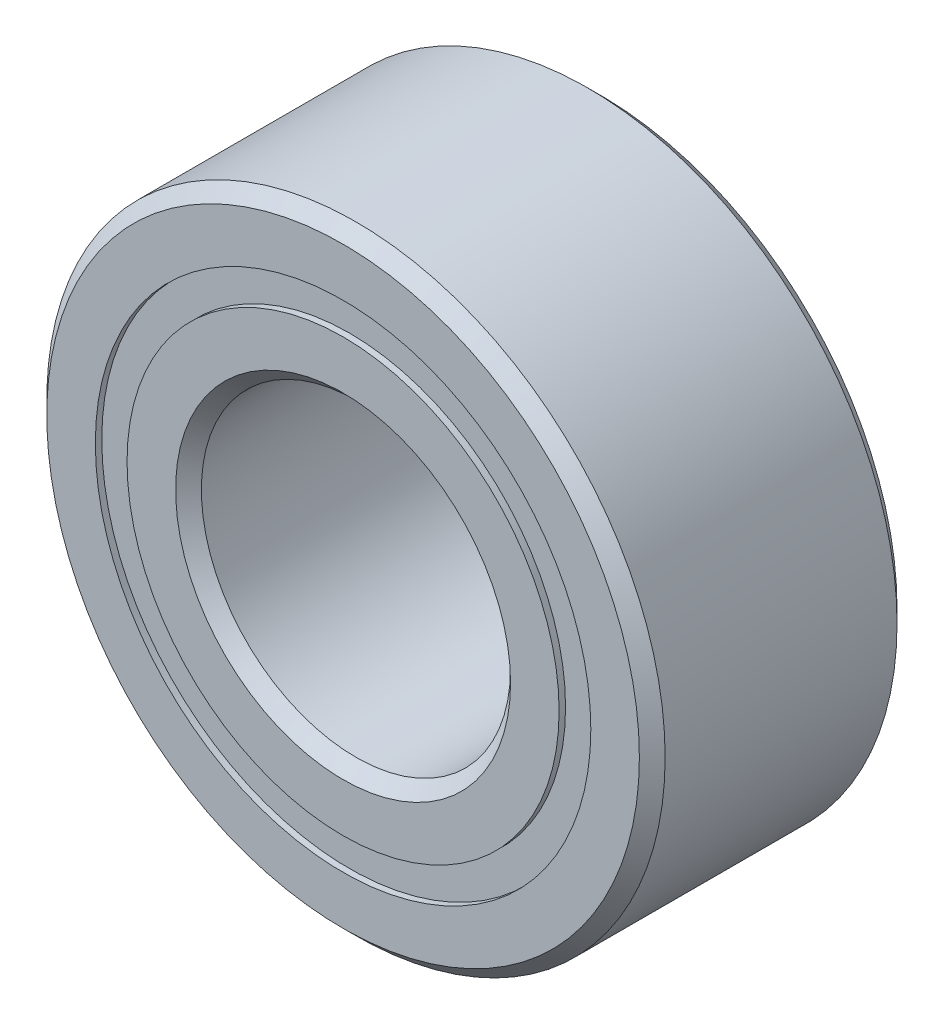
ISO-10303-21;
HEADER;
FILE_DESCRIPTION(('STEP AP214'),'2;1');
FILE_NAME('part.step','',(''),(''),'','','');
FILE_SCHEMA(('AUTOMOTIVE_DESIGN { 1 0 10303 214 1 1 1 1 }'));
ENDSEC;
DATA;
#1=APPLICATION_CONTEXT('core data for automotive mechanical design processes');
#2=APPLICATION_PROTOCOL_DEFINITION('international standard','automotive_design',2000,#1);
#3=PRODUCT_CONTEXT('',#1,'mechanical');
#4=PRODUCT('Part','Part','',(#3));
#5=PRODUCT_RELATED_PRODUCT_CATEGORY('part','',(#4));
#6=PRODUCT_DEFINITION_FORMATION('','',#4);
#7=PRODUCT_DEFINITION_CONTEXT('part definition',#1,'design');
#8=PRODUCT_DEFINITION('design','',#6,#7);
#9=PRODUCT_DEFINITION_SHAPE('','',#8);
#10=(LENGTH_UNIT() NAMED_UNIT(*) SI_UNIT(.MILLI.,.METRE.));
#11=(NAMED_UNIT(*) PLANE_ANGLE_UNIT() SI_UNIT($,.RADIAN.));
#12=(NAMED_UNIT(*) SI_UNIT($,.STERADIAN.) SOLID_ANGLE_UNIT());
#13=UNCERTAINTY_MEASURE_WITH_UNIT(LENGTH_MEASURE(1.E-05),#10,'distance_accuracy_value','');
#14=(GEOMETRIC_REPRESENTATION_CONTEXT(3) GLOBAL_UNCERTAINTY_ASSIGNED_CONTEXT((#13)) GLOBAL_UNIT_ASSIGNED_CONTEXT((#10,
#11,#12)) REPRESENTATION_CONTEXT('',''));
#15=CARTESIAN_POINT('',(0.,0.,0.));
#16=DIRECTION('',(0.,0.,1.));
#17=DIRECTION('',(1.,0.,0.));
#18=AXIS2_PLACEMENT_3D('',#15,#16,#17);
#19=CARTESIAN_POINT('',(0.,2.40384615384615,-1.1875));
#20=DIRECTION('',(0.,0.,1.));
#21=DIRECTION('',(1.,0.,0.));
#22=AXIS2_PLACEMENT_3D('',#19,#20,#21);
#23=PLANE('',#22);
#24=CARTESIAN_POINT('',(0.,0.,-1.1875));
#25=DIRECTION('',(0.,0.,1.));
#26=DIRECTION('',(1.,0.,0.));
#27=AXIS2_PLACEMENT_3D('',#24,#25,#26);
#28=CIRCLE('',#27,2.40384615384615);
#29=CARTESIAN_POINT('',(2.40384615384615,0.,-1.1875));
#30=VERTEX_POINT('',#29);
#31=EDGE_CURVE('E55',#30,#30,#28,.T.);
#32=ORIENTED_EDGE('',*,*,#31,.F.);
#33=EDGE_LOOP('',(#32));
#34=FACE_BOUND('',#33,.T.);
#35=CARTESIAN_POINT('',(0.,0.,-1.1875));
#36=DIRECTION('',(0.,0.,1.));
#37=DIRECTION('',(1.,0.,0.));
#38=AXIS2_PLACEMENT_3D('',#35,#36,#37);
#39=CIRCLE('',#38,2.09615384615385);
#40=CARTESIAN_POINT('',(2.09615384615385,0.,-1.1875));
#41=VERTEX_POINT('',#40);
#42=EDGE_CURVE('E11',#41,#41,#39,.T.);
#43=ORIENTED_EDGE('',*,*,#42,.T.);
#44=EDGE_LOOP('',(#43));
#45=FACE_BOUND('',#44,.T.);
#46=ADVANCED_FACE('F41',(#34,#45),#23,.F.);
#47=CARTESIAN_POINT('',(0.,0.,1.25));
#48=DIRECTION('',(0.,0.,1.));
#49=DIRECTION('',(1.,0.,0.));
#50=AXIS2_PLACEMENT_3D('',#47,#48,#49);
#51=CYLINDRICAL_SURFACE('',#50,2.09615384615385);
#52=ORIENTED_EDGE('',*,*,#42,.F.);
#53=EDGE_LOOP('',(#52));
#54=FACE_BOUND('',#53,.T.);
#55=CARTESIAN_POINT('',(0.,0.,-0.576463888168111));
#56=DIRECTION('',(0.,0.,1.));
#57=DIRECTION('',(1.,0.,0.));
#58=AXIS2_PLACEMENT_3D('',#55,#56,#57);
#59=CIRCLE('',#58,2.09615384615385);
#60=CARTESIAN_POINT('',(2.09615384615385,0.,-0.576463888168111));
#61=VERTEX_POINT('',#60);
#62=EDGE_CURVE('E47',#61,#61,#59,.T.);
#63=ORIENTED_EDGE('',*,*,#62,.T.);
#64=EDGE_LOOP('',(#63));
#65=FACE_BOUND('',#64,.T.);
#66=ADVANCED_FACE('F64',(#54,#65),#51,.F.);
#67=CARTESIAN_POINT('',(0.,2.40384615384615,-0.576463888168111));
#68=DIRECTION('',(0.,0.,-1.));
#69=DIRECTION('',(-1.,0.,0.));
#70=AXIS2_PLACEMENT_3D('',#67,#68,#69);
#71=PLANE('',#70);
#72=ORIENTED_EDGE('',*,*,#62,.F.);
#73=EDGE_LOOP('',(#72));
#74=FACE_BOUND('',#73,.T.);
#75=CARTESIAN_POINT('',(0.,0.,-0.576463888168111));
#76=DIRECTION('',(0.,0.,1.));
#77=DIRECTION('',(1.,0.,0.));
#78=AXIS2_PLACEMENT_3D('',#75,#76,#77);
#79=CIRCLE('',#78,2.40384615384615);
#80=CARTESIAN_POINT('',(2.40384615384615,0.,-0.576463888168111));
#81=VERTEX_POINT('',#80);
#82=EDGE_CURVE('E51',#81,#81,#79,.T.);
#83=ORIENTED_EDGE('',*,*,#82,.T.);
#84=EDGE_LOOP('',(#83));
#85=FACE_BOUND('',#84,.T.);
#86=ADVANCED_FACE('F68',(#74,#85),#71,.F.);
#87=CARTESIAN_POINT('',(0.,0.,1.25));
#88=DIRECTION('',(0.,0.,1.));
#89=DIRECTION('',(1.,0.,0.));
#90=AXIS2_PLACEMENT_3D('',#87,#88,#89);
#91=CYLINDRICAL_SURFACE('',#90,2.40384615384615);
#92=ORIENTED_EDGE('',*,*,#82,.F.);
#93=EDGE_LOOP('',(#92));
#94=FACE_BOUND('',#93,.T.);
#95=ORIENTED_EDGE('',*,*,#31,.T.);
#96=EDGE_LOOP('',(#95));
#97=FACE_BOUND('',#96,.T.);
#98=ADVANCED_FACE('F61',(#94,#97),#91,.T.);
#99=CLOSED_SHELL('',(#46,#66,#86,#98));
#100=MANIFOLD_SOLID_BREP('B2',#99);
#101=CARTESIAN_POINT('',(0.,2.40384615384615,1.1875));
#102=DIRECTION('',(0.,0.,-1.));
#103=DIRECTION('',(-1.,0.,0.));
#104=AXIS2_PLACEMENT_3D('',#101,#102,#103);
#105=PLANE('',#104);
#106=CARTESIAN_POINT('',(0.,0.,1.1875));
#107=DIRECTION('',(0.,0.,1.));
#108=DIRECTION('',(1.,0.,0.));
#109=AXIS2_PLACEMENT_3D('',#106,#107,#108);
#110=CIRCLE('',#109,2.09615384615385);
#111=CARTESIAN_POINT('',(2.09615384615385,0.,1.1875));
#112=VERTEX_POINT('',#111);
#113=EDGE_CURVE('E40',#112,#112,#110,.T.);
#114=ORIENTED_EDGE('',*,*,#113,.F.);
#115=EDGE_LOOP('',(#114));
#116=FACE_BOUND('',#115,.T.);
#117=CARTESIAN_POINT('',(0.,0.,1.1875));
#118=DIRECTION('',(0.,0.,1.));
#119=DIRECTION('',(1.,0.,0.));
#120=AXIS2_PLACEMENT_3D('',#117,#118,#119);
#121=CIRCLE('',#120,2.40384615384615);
#122=CARTESIAN_POINT('',(2.40384615384615,0.,1.1875));
#123=VERTEX_POINT('',#122);
#124=EDGE_CURVE('E122',#123,#123,#121,.T.);
#125=ORIENTED_EDGE('',*,*,#124,.T.);
#126=EDGE_LOOP('',(#125));
#127=FACE_BOUND('',#126,.T.);
#128=ADVANCED_FACE('F108',(#116,#127),#105,.F.);
#129=CARTESIAN_POINT('',(0.,0.,1.25));
#130=DIRECTION('',(0.,0.,1.));
#131=DIRECTION('',(1.,0.,0.));
#132=AXIS2_PLACEMENT_3D('',#129,#130,#131);
#133=CYLINDRICAL_SURFACE('',#132,2.09615384615385);
#134=CARTESIAN_POINT('',(0.,0.,0.576463888168111));
#135=DIRECTION('',(0.,0.,1.));
#136=DIRECTION('',(1.,0.,0.));
#137=AXIS2_PLACEMENT_3D('',#134,#135,#136);
#138=CIRCLE('',#137,2.09615384615385);
#139=CARTESIAN_POINT('',(2.09615384615385,0.,0.576463888168111));
#140=VERTEX_POINT('',#139);
#141=EDGE_CURVE('E114',#140,#140,#138,.T.);
#142=ORIENTED_EDGE('',*,*,#141,.F.);
#143=EDGE_LOOP('',(#142));
#144=FACE_BOUND('',#143,.T.);
#145=ORIENTED_EDGE('',*,*,#113,.T.);
#146=EDGE_LOOP('',(#145));
#147=FACE_BOUND('',#146,.T.);
#148=ADVANCED_FACE('F137',(#144,#147),#133,.F.);
#149=CARTESIAN_POINT('',(0.,2.40384615384615,0.576463888168111));
#150=DIRECTION('',(0.,0.,1.));
#151=DIRECTION('',(1.,0.,0.));
#152=AXIS2_PLACEMENT_3D('',#149,#150,#151);
#153=PLANE('',#152);
#154=CARTESIAN_POINT('',(0.,0.,0.576463888168111));
#155=DIRECTION('',(0.,0.,1.));
#156=DIRECTION('',(1.,0.,0.));
#157=AXIS2_PLACEMENT_3D('',#154,#155,#156);
#158=CIRCLE('',#157,2.40384615384615);
#159=CARTESIAN_POINT('',(2.40384615384615,0.,0.576463888168111));
#160=VERTEX_POINT('',#159);
#161=EDGE_CURVE('E118',#160,#160,#158,.T.);
#162=ORIENTED_EDGE('',*,*,#161,.F.);
#163=EDGE_LOOP('',(#162));
#164=FACE_BOUND('',#163,.T.);
#165=ORIENTED_EDGE('',*,*,#141,.T.);
#166=EDGE_LOOP('',(#165));
#167=FACE_BOUND('',#166,.T.);
#168=ADVANCED_FACE('F132',(#164,#167),#153,.F.);
#169=CARTESIAN_POINT('',(0.,0.,1.25));
#170=DIRECTION('',(0.,0.,1.));
#171=DIRECTION('',(1.,0.,0.));
#172=AXIS2_PLACEMENT_3D('',#169,#170,#171);
#173=CYLINDRICAL_SURFACE('',#172,2.40384615384615);
#174=ORIENTED_EDGE('',*,*,#124,.F.);
#175=EDGE_LOOP('',(#174));
#176=FACE_BOUND('',#175,.T.);
#177=ORIENTED_EDGE('',*,*,#161,.T.);
#178=EDGE_LOOP('',(#177));
#179=FACE_BOUND('',#178,.T.);
#180=ADVANCED_FACE('F129',(#176,#179),#173,.T.);
#181=CLOSED_SHELL('',(#128,#148,#168,#180));
#182=MANIFOLD_SOLID_BREP('B6',#181);
#183=CARTESIAN_POINT('',(-1.12499999999998,1.948557158515,0.));
#184=DIRECTION('',(0.,0.,1.));
#185=DIRECTION('',(-0.499999999999989,0.866025403784445,0.));
#186=AXIS2_PLACEMENT_3D('',#183,#184,#185);
#187=SPHERICAL_SURFACE('',#186,0.576463888168111);
#188=CARTESIAN_POINT('',(-1.12499999999998,1.948557158515,0.576463888168111));
#189=VERTEX_POINT('',#188);
#190=VERTEX_LOOP('',#189);
#191=FACE_BOUND('',#190,.T.);
#192=ADVANCED_FACE('F175',(#191),#187,.T.);
#193=CLOSED_SHELL('',(#192));
#194=MANIFOLD_SOLID_BREP('B35',#193);
#195=CARTESIAN_POINT('',(-1.94855715851497,1.12500000000002,0.));
#196=DIRECTION('',(0.,0.,1.));
#197=DIRECTION('',(-0.866025403784433,0.50000000000001,0.));
#198=AXIS2_PLACEMENT_3D('',#195,#196,#197);
#199=SPHERICAL_SURFACE('',#198,0.576463888168111);
#200=CARTESIAN_POINT('',(-1.94855715851497,1.12500000000002,0.576463888168111));
#201=VERTEX_POINT('',#200);
#202=VERTEX_LOOP('',#201);
#203=FACE_BOUND('',#202,.T.);
#204=ADVANCED_FACE('F195',(#203),#199,.T.);
#205=CLOSED_SHELL('',(#204));
#206=MANIFOLD_SOLID_BREP('B104',#205);
#207=CARTESIAN_POINT('',(-2.25,0.,0.));
#208=DIRECTION('',(0.,0.,1.));
#209=DIRECTION('',(-1.,0.,0.));
#210=AXIS2_PLACEMENT_3D('',#207,#208,#209);
#211=SPHERICAL_SURFACE('',#210,0.576463888168111);
#212=CARTESIAN_POINT('',(-2.25,0.,0.576463888168111));
#213=VERTEX_POINT('',#212);
#214=VERTEX_LOOP('',#213);
#215=FACE_BOUND('',#214,.T.);
#216=ADVANCED_FACE('F215',(#215),#211,.T.);
#217=CLOSED_SHELL('',(#216));
#218=MANIFOLD_SOLID_BREP('B171',#217);
#219=CARTESIAN_POINT('',(-1.948557158515,-1.12499999999998,0.));
#220=DIRECTION('',(0.,0.,1.));
#221=DIRECTION('',(-0.866025403784443,-0.499999999999992,0.));
#222=AXIS2_PLACEMENT_3D('',#219,#220,#221);
#223=SPHERICAL_SURFACE('',#222,0.576463888168111);
#224=CARTESIAN_POINT('',(-1.948557158515,-1.12499999999998,0.576463888168111));
#225=VERTEX_POINT('',#224);
#226=VERTEX_LOOP('',#225);
#227=FACE_BOUND('',#226,.T.);
#228=ADVANCED_FACE('F235',(#227),#223,.T.);
#229=CLOSED_SHELL('',(#228));
#230=MANIFOLD_SOLID_BREP('B191',#229);
#231=CARTESIAN_POINT('',(-1.12500000000002,-1.94855715851498,0.));
#232=DIRECTION('',(0.,0.,1.));
#233=DIRECTION('',(-0.500000000000007,-0.866025403784435,0.));
#234=AXIS2_PLACEMENT_3D('',#231,#232,#233);
#235=SPHERICAL_SURFACE('',#234,0.576463888168111);
#236=CARTESIAN_POINT('',(-1.12500000000002,-1.94855715851498,0.576463888168111));
#237=VERTEX_POINT('',#236);
#238=VERTEX_LOOP('',#237);
#239=FACE_BOUND('',#238,.T.);
#240=ADVANCED_FACE('F255',(#239),#235,.T.);
#241=CLOSED_SHELL('',(#240));
#242=MANIFOLD_SOLID_BREP('B211',#241);
#243=CARTESIAN_POINT('',(0.,-2.25,0.));
#244=DIRECTION('',(0.,0.,1.));
#245=DIRECTION('',(0.,-1.,0.));
#246=AXIS2_PLACEMENT_3D('',#243,#244,#245);
#247=SPHERICAL_SURFACE('',#246,0.576463888168111);
#248=CARTESIAN_POINT('',(0.,-2.25,0.576463888168111));
#249=VERTEX_POINT('',#248);
#250=VERTEX_LOOP('',#249);
#251=FACE_BOUND('',#250,.T.);
#252=ADVANCED_FACE('F275',(#251),#247,.T.);
#253=CLOSED_SHELL('',(#252));
#254=MANIFOLD_SOLID_BREP('B231',#253);
#255=CARTESIAN_POINT('',(1.12499999999999,-1.94855715851499,0.));
#256=DIRECTION('',(0.,0.,1.));
#257=DIRECTION('',(0.499999999999995,-0.866025403784442,0.));
#258=AXIS2_PLACEMENT_3D('',#255,#256,#257);
#259=SPHERICAL_SURFACE('',#258,0.576463888168111);
#260=CARTESIAN_POINT('',(1.12499999999999,-1.94855715851499,0.576463888168111));
#261=VERTEX_POINT('',#260);
#262=VERTEX_LOOP('',#261);
#263=FACE_BOUND('',#262,.T.);
#264=ADVANCED_FACE('F295',(#263),#259,.T.);
#265=CLOSED_SHELL('',(#264));
#266=MANIFOLD_SOLID_BREP('B251',#265);
#267=CARTESIAN_POINT('',(1.94855715851498,-1.12500000000001,0.));
#268=DIRECTION('',(0.,0.,1.));
#269=DIRECTION('',(0.866025403784436,-0.500000000000004,0.));
#270=AXIS2_PLACEMENT_3D('',#267,#268,#269);
#271=SPHERICAL_SURFACE('',#270,0.576463888168111);
#272=CARTESIAN_POINT('',(1.94855715851498,-1.12500000000001,0.576463888168111));
#273=VERTEX_POINT('',#272);
#274=VERTEX_LOOP('',#273);
#275=FACE_BOUND('',#274,.T.);
#276=ADVANCED_FACE('F315',(#275),#271,.T.);
#277=CLOSED_SHELL('',(#276));
#278=MANIFOLD_SOLID_BREP('B271',#277);
#279=CARTESIAN_POINT('',(2.25,0.,0.));
#280=DIRECTION('',(0.,0.,1.));
#281=DIRECTION('',(1.,0.,0.));
#282=AXIS2_PLACEMENT_3D('',#279,#280,#281);
#283=SPHERICAL_SURFACE('',#282,0.576463888168111);
#284=CARTESIAN_POINT('',(2.25,0.,0.576463888168111));
#285=VERTEX_POINT('',#284);
#286=VERTEX_LOOP('',#285);
#287=FACE_BOUND('',#286,.T.);
#288=ADVANCED_FACE('F335',(#287),#283,.T.);
#289=CLOSED_SHELL('',(#288));
#290=MANIFOLD_SOLID_BREP('B291',#289);
#291=CARTESIAN_POINT('',(1.94855715851499,1.125,0.));
#292=DIRECTION('',(0.,0.,1.));
#293=DIRECTION('',(0.86602540378444,0.499999999999998,0.));
#294=AXIS2_PLACEMENT_3D('',#291,#292,#293);
#295=SPHERICAL_SURFACE('',#294,0.576463888168111);
#296=CARTESIAN_POINT('',(1.94855715851499,1.125,0.576463888168111));
#297=VERTEX_POINT('',#296);
#298=VERTEX_LOOP('',#297);
#299=FACE_BOUND('',#298,.T.);
#300=ADVANCED_FACE('F355',(#299),#295,.T.);
#301=CLOSED_SHELL('',(#300));
#302=MANIFOLD_SOLID_BREP('B311',#301);
#303=CARTESIAN_POINT('',(1.125,1.94855715851499,0.));
#304=DIRECTION('',(0.,0.,1.));
#305=DIRECTION('',(0.500000000000001,0.866025403784438,0.));
#306=AXIS2_PLACEMENT_3D('',#303,#304,#305);
#307=SPHERICAL_SURFACE('',#306,0.576463888168111);
#308=CARTESIAN_POINT('',(1.125,1.94855715851499,0.576463888168111));
#309=VERTEX_POINT('',#308);
#310=VERTEX_LOOP('',#309);
#311=FACE_BOUND('',#310,.T.);
#312=ADVANCED_FACE('F375',(#311),#307,.T.);
#313=CLOSED_SHELL('',(#312));
#314=MANIFOLD_SOLID_BREP('B331',#313);
#315=CARTESIAN_POINT('',(0.,2.25,0.));
#316=DIRECTION('',(0.,0.,1.));
#317=DIRECTION('',(0.,1.,0.));
#318=AXIS2_PLACEMENT_3D('',#315,#316,#317);
#319=SPHERICAL_SURFACE('',#318,0.576463888168111);
#320=CARTESIAN_POINT('',(0.,2.25,0.576463888168111));
#321=VERTEX_POINT('',#320);
#322=VERTEX_LOOP('',#321);
#323=FACE_BOUND('',#322,.T.);
#324=ADVANCED_FACE('F397',(#323),#319,.T.);
#325=CLOSED_SHELL('',(#324));
#326=MANIFOLD_SOLID_BREP('B351',#325);
#327=CARTESIAN_POINT('',(0.,2.09615384615385,1.25));
#328=DIRECTION('',(0.,0.,-1.));
#329=DIRECTION('',(-1.,0.,0.));
#330=AXIS2_PLACEMENT_3D('',#327,#328,#329);
#331=PLANE('',#330);
#332=CARTESIAN_POINT('',(0.,0.,1.25));
#333=DIRECTION('',(0.,0.,1.));
#334=DIRECTION('',(1.,0.,0.));
#335=AXIS2_PLACEMENT_3D('',#332,#333,#334);
#336=CIRCLE('',#335,1.625);
#337=CARTESIAN_POINT('',(1.625,0.,1.25));
#338=VERTEX_POINT('',#337);
#339=EDGE_CURVE('E444',#338,#338,#336,.T.);
#340=ORIENTED_EDGE('',*,*,#339,.F.);
#341=EDGE_LOOP('',(#340));
#342=FACE_BOUND('',#341,.T.);
#343=CARTESIAN_POINT('',(0.,0.,1.25));
#344=DIRECTION('',(0.,0.,1.));
#345=DIRECTION('',(1.,0.,0.));
#346=AXIS2_PLACEMENT_3D('',#343,#344,#345);
#347=CIRCLE('',#346,2.09615384615385);
#348=CARTESIAN_POINT('',(2.09615384615385,0.,1.25));
#349=VERTEX_POINT('',#348);
#350=EDGE_CURVE('E396',#349,#349,#347,.T.);
#351=ORIENTED_EDGE('',*,*,#350,.T.);
#352=EDGE_LOOP('',(#351));
#353=FACE_BOUND('',#352,.T.);
#354=ADVANCED_FACE('F416',(#342,#353),#331,.F.);
#355=CARTESIAN_POINT('',(0.,0.,1.25));
#356=DIRECTION('',(0.,0.,1.));
#357=DIRECTION('',(1.,0.,0.));
#358=AXIS2_PLACEMENT_3D('',#355,#356,#357);
#359=CYLINDRICAL_SURFACE('',#358,2.09615384615385);
#360=ORIENTED_EDGE('',*,*,#350,.F.);
#361=EDGE_LOOP('',(#360));
#362=FACE_BOUND('',#361,.T.);
#363=CARTESIAN_POINT('',(0.,0.,0.555555555555555));
#364=DIRECTION('',(0.,0.,1.));
#365=DIRECTION('',(1.,0.,0.));
#366=AXIS2_PLACEMENT_3D('',#363,#364,#365);
#367=CIRCLE('',#366,2.09615384615385);
#368=CARTESIAN_POINT('',(2.09615384615385,0.,0.555555555555555));
#369=VERTEX_POINT('',#368);
#370=EDGE_CURVE('E422',#369,#369,#367,.T.);
#371=ORIENTED_EDGE('',*,*,#370,.T.);
#372=EDGE_LOOP('',(#371));
#373=FACE_BOUND('',#372,.T.);
#374=ADVANCED_FACE('F451',(#362,#373),#359,.T.);
#375=CARTESIAN_POINT('',(0.,0.,0.));
#376=DIRECTION('',(0.,0.,1.));
#377=DIRECTION('',(1.,0.,0.));
#378=AXIS2_PLACEMENT_3D('',#375,#376,#377);
#379=TOROIDAL_SURFACE('',#378,2.25,0.57646388816811);
#380=ORIENTED_EDGE('',*,*,#370,.F.);
#381=EDGE_LOOP('',(#380));
#382=FACE_BOUND('',#381,.T.);
#383=CARTESIAN_POINT('',(0.,0.,-0.555555555555556));
#384=DIRECTION('',(0.,0.,1.));
#385=DIRECTION('',(1.,0.,0.));
#386=AXIS2_PLACEMENT_3D('',#383,#384,#385);
#387=CIRCLE('',#386,2.09615384615385);
#388=CARTESIAN_POINT('',(2.09615384615385,0.,-0.555555555555556));
#389=VERTEX_POINT('',#388);
#390=EDGE_CURVE('E426',#389,#389,#387,.T.);
#391=ORIENTED_EDGE('',*,*,#390,.T.);
#392=EDGE_LOOP('',(#391));
#393=FACE_BOUND('',#392,.T.);
#394=ADVANCED_FACE('F455',(#382,#393),#379,.F.);
#395=CARTESIAN_POINT('',(0.,0.,1.25));
#396=DIRECTION('',(0.,0.,1.));
#397=DIRECTION('',(1.,0.,0.));
#398=AXIS2_PLACEMENT_3D('',#395,#396,#397);
#399=CYLINDRICAL_SURFACE('',#398,2.09615384615385);
#400=ORIENTED_EDGE('',*,*,#390,.F.);
#401=EDGE_LOOP('',(#400));
#402=FACE_BOUND('',#401,.T.);
#403=CARTESIAN_POINT('',(0.,0.,-1.25));
#404=DIRECTION('',(0.,0.,1.));
#405=DIRECTION('',(1.,0.,0.));
#406=AXIS2_PLACEMENT_3D('',#403,#404,#405);
#407=CIRCLE('',#406,2.09615384615385);
#408=CARTESIAN_POINT('',(2.09615384615385,0.,-1.25));
#409=VERTEX_POINT('',#408);
#410=EDGE_CURVE('E430',#409,#409,#407,.T.);
#411=ORIENTED_EDGE('',*,*,#410,.T.);
#412=EDGE_LOOP('',(#411));
#413=FACE_BOUND('',#412,.T.);
#414=ADVANCED_FACE('F460',(#402,#413),#399,.T.);
#415=CARTESIAN_POINT('',(0.,1.625,-1.25));
#416=DIRECTION('',(0.,0.,1.));
#417=DIRECTION('',(1.,0.,0.));
#418=AXIS2_PLACEMENT_3D('',#415,#416,#417);
#419=PLANE('',#418);
#420=ORIENTED_EDGE('',*,*,#410,.F.);
#421=EDGE_LOOP('',(#420));
#422=FACE_BOUND('',#421,.T.);
#423=CARTESIAN_POINT('',(0.,0.,-1.25));
#424=DIRECTION('',(0.,0.,1.));
#425=DIRECTION('',(1.,0.,0.));
#426=AXIS2_PLACEMENT_3D('',#423,#424,#425);
#427=CIRCLE('',#426,1.625);
#428=CARTESIAN_POINT('',(1.625,0.,-1.25));
#429=VERTEX_POINT('',#428);
#430=EDGE_CURVE('E435',#429,#429,#427,.T.);
#431=ORIENTED_EDGE('',*,*,#430,.T.);
#432=EDGE_LOOP('',(#431));
#433=FACE_BOUND('',#432,.T.);
#434=ADVANCED_FACE('F466',(#422,#433),#419,.F.);
#435=CARTESIAN_POINT('',(0.,0.,-1.125));
#436=DIRECTION('',(0.,0.,-1.));
#437=DIRECTION('',(-1.,0.,0.));
#438=AXIS2_PLACEMENT_3D('',#435,#436,#437);
#439=CONICAL_SURFACE('',#438,1.5,0.785398163397446);
#440=ORIENTED_EDGE('',*,*,#430,.F.);
#441=EDGE_LOOP('',(#440));
#442=FACE_BOUND('',#441,.T.);
#443=CARTESIAN_POINT('',(0.,0.,-1.125));
#444=DIRECTION('',(0.,0.,1.));
#445=DIRECTION('',(1.,0.,0.));
#446=AXIS2_PLACEMENT_3D('',#443,#444,#445);
#447=CIRCLE('',#446,1.5);
#448=CARTESIAN_POINT('',(1.5,0.,-1.125));
#449=VERTEX_POINT('',#448);
#450=EDGE_CURVE('E438',#449,#449,#447,.T.);
#451=ORIENTED_EDGE('',*,*,#450,.T.);
#452=EDGE_LOOP('',(#451));
#453=FACE_BOUND('',#452,.T.);
#454=ADVANCED_FACE('F470',(#442,#453),#439,.F.);
#455=CARTESIAN_POINT('',(0.,0.,1.25));
#456=DIRECTION('',(0.,0.,1.));
#457=DIRECTION('',(1.,0.,0.));
#458=AXIS2_PLACEMENT_3D('',#455,#456,#457);
#459=CYLINDRICAL_SURFACE('',#458,1.5);
#460=ORIENTED_EDGE('',*,*,#450,.F.);
#461=EDGE_LOOP('',(#460));
#462=FACE_BOUND('',#461,.T.);
#463=CARTESIAN_POINT('',(0.,0.,1.125));
#464=DIRECTION('',(0.,0.,1.));
#465=DIRECTION('',(1.,0.,0.));
#466=AXIS2_PLACEMENT_3D('',#463,#464,#465);
#467=CIRCLE('',#466,1.5);
#468=CARTESIAN_POINT('',(1.5,0.,1.125));
#469=VERTEX_POINT('',#468);
#470=EDGE_CURVE('E441',#469,#469,#467,.T.);
#471=ORIENTED_EDGE('',*,*,#470,.T.);
#472=EDGE_LOOP('',(#471));
#473=FACE_BOUND('',#472,.T.);
#474=ADVANCED_FACE('F474',(#462,#473),#459,.F.);
#475=CARTESIAN_POINT('',(0.,0.,1.25));
#476=DIRECTION('',(0.,0.,1.));
#477=DIRECTION('',(1.,0.,0.));
#478=AXIS2_PLACEMENT_3D('',#475,#476,#477);
#479=CONICAL_SURFACE('',#478,1.625,0.78539816339745);
#480=ORIENTED_EDGE('',*,*,#470,.F.);
#481=EDGE_LOOP('',(#480));
#482=FACE_BOUND('',#481,.T.);
#483=ORIENTED_EDGE('',*,*,#339,.T.);
#484=EDGE_LOOP('',(#483));
#485=FACE_BOUND('',#484,.T.);
#486=ADVANCED_FACE('F448',(#482,#485),#479,.F.);
#487=CLOSED_SHELL('',(#354,#374,#394,#414,#434,#454,#474,#486));
#488=MANIFOLD_SOLID_BREP('B371',#487);
#489=CARTESIAN_POINT('',(0.,0.,1.125));
#490=DIRECTION('',(0.,0.,-1.));
#491=DIRECTION('',(-1.,0.,0.));
#492=AXIS2_PLACEMENT_3D('',#489,#490,#491);
#493=CONICAL_SURFACE('',#492,3.,0.785398163397447);
#494=CARTESIAN_POINT('',(0.,0.,1.25));
#495=DIRECTION('',(0.,0.,1.));
#496=DIRECTION('',(1.,0.,0.));
#497=AXIS2_PLACEMENT_3D('',#494,#495,#496);
#498=CIRCLE('',#497,2.875);
#499=CARTESIAN_POINT('',(2.875,0.,1.25));
#500=VERTEX_POINT('',#499);
#501=EDGE_CURVE('E565',#500,#500,#498,.T.);
#502=ORIENTED_EDGE('',*,*,#501,.F.);
#503=EDGE_LOOP('',(#502));
#504=FACE_BOUND('',#503,.T.);
#505=CARTESIAN_POINT('',(0.,0.,1.125));
#506=DIRECTION('',(0.,0.,1.));
#507=DIRECTION('',(1.,0.,0.));
#508=AXIS2_PLACEMENT_3D('',#505,#506,#507);
#509=CIRCLE('',#508,3.);
#510=CARTESIAN_POINT('',(3.,0.,1.125));
#511=VERTEX_POINT('',#510);
#512=EDGE_CURVE('E415',#511,#511,#509,.T.);
#513=ORIENTED_EDGE('',*,*,#512,.T.);
#514=EDGE_LOOP('',(#513));
#515=FACE_BOUND('',#514,.T.);
#516=ADVANCED_FACE('F537',(#504,#515),#493,.T.);
#517=CARTESIAN_POINT('',(0.,0.,1.25));
#518=DIRECTION('',(0.,0.,1.));
#519=DIRECTION('',(1.,0.,0.));
#520=AXIS2_PLACEMENT_3D('',#517,#518,#519);
#521=CYLINDRICAL_SURFACE('',#520,3.);
#522=ORIENTED_EDGE('',*,*,#512,.F.);
#523=EDGE_LOOP('',(#522));
#524=FACE_BOUND('',#523,.T.);
#525=CARTESIAN_POINT('',(0.,0.,-1.125));
#526=DIRECTION('',(0.,0.,1.));
#527=DIRECTION('',(1.,0.,0.));
#528=AXIS2_PLACEMENT_3D('',#525,#526,#527);
#529=CIRCLE('',#528,3.);
#530=CARTESIAN_POINT('',(3.,0.,-1.125));
#531=VERTEX_POINT('',#530);
#532=EDGE_CURVE('E543',#531,#531,#529,.T.);
#533=ORIENTED_EDGE('',*,*,#532,.T.);
#534=EDGE_LOOP('',(#533));
#535=FACE_BOUND('',#534,.T.);
#536=ADVANCED_FACE('F572',(#524,#535),#521,.T.);
#537=CARTESIAN_POINT('',(0.,0.,-1.25));
#538=DIRECTION('',(0.,0.,1.));
#539=DIRECTION('',(1.,0.,0.));
#540=AXIS2_PLACEMENT_3D('',#537,#538,#539);
#541=CONICAL_SURFACE('',#540,2.875,0.785398163397447);
#542=ORIENTED_EDGE('',*,*,#532,.F.);
#543=EDGE_LOOP('',(#542));
#544=FACE_BOUND('',#543,.T.);
#545=CARTESIAN_POINT('',(0.,0.,-1.25));
#546=DIRECTION('',(0.,0.,1.));
#547=DIRECTION('',(1.,0.,0.));
#548=AXIS2_PLACEMENT_3D('',#545,#546,#547);
#549=CIRCLE('',#548,2.875);
#550=CARTESIAN_POINT('',(2.875,0.,-1.25));
#551=VERTEX_POINT('',#550);
#552=EDGE_CURVE('E547',#551,#551,#549,.T.);
#553=ORIENTED_EDGE('',*,*,#552,.T.);
#554=EDGE_LOOP('',(#553));
#555=FACE_BOUND('',#554,.T.);
#556=ADVANCED_FACE('F576',(#544,#555),#541,.T.);
#557=CARTESIAN_POINT('',(0.,2.875,-1.25));
#558=DIRECTION('',(0.,0.,1.));
#559=DIRECTION('',(1.,0.,0.));
#560=AXIS2_PLACEMENT_3D('',#557,#558,#559);
#561=PLANE('',#560);
#562=ORIENTED_EDGE('',*,*,#552,.F.);
#563=EDGE_LOOP('',(#562));
#564=FACE_BOUND('',#563,.T.);
#565=CARTESIAN_POINT('',(0.,0.,-1.25));
#566=DIRECTION('',(0.,0.,1.));
#567=DIRECTION('',(1.,0.,0.));
#568=AXIS2_PLACEMENT_3D('',#565,#566,#567);
#569=CIRCLE('',#568,2.40384615384615);
#570=CARTESIAN_POINT('',(2.40384615384615,0.,-1.25));
#571=VERTEX_POINT('',#570);
#572=EDGE_CURVE('E551',#571,#571,#569,.T.);
#573=ORIENTED_EDGE('',*,*,#572,.T.);
#574=EDGE_LOOP('',(#573));
#575=FACE_BOUND('',#574,.T.);
#576=ADVANCED_FACE('F581',(#564,#575),#561,.F.);
#577=CARTESIAN_POINT('',(0.,0.,1.25));
#578=DIRECTION('',(0.,0.,1.));
#579=DIRECTION('',(1.,0.,0.));
#580=AXIS2_PLACEMENT_3D('',#577,#578,#579);
#581=CYLINDRICAL_SURFACE('',#580,2.40384615384615);
#582=ORIENTED_EDGE('',*,*,#572,.F.);
#583=EDGE_LOOP('',(#582));
#584=FACE_BOUND('',#583,.T.);
#585=CARTESIAN_POINT('',(0.,0.,-0.555555555555556));
#586=DIRECTION('',(0.,0.,1.));
#587=DIRECTION('',(1.,0.,0.));
#588=AXIS2_PLACEMENT_3D('',#585,#586,#587);
#589=CIRCLE('',#588,2.40384615384615);
#590=CARTESIAN_POINT('',(2.40384615384615,0.,-0.555555555555556));
#591=VERTEX_POINT('',#590);
#592=EDGE_CURVE('E556',#591,#591,#589,.T.);
#593=ORIENTED_EDGE('',*,*,#592,.T.);
#594=EDGE_LOOP('',(#593));
#595=FACE_BOUND('',#594,.T.);
#596=ADVANCED_FACE('F587',(#584,#595),#581,.F.);
#597=CARTESIAN_POINT('',(0.,0.,0.));
#598=DIRECTION('',(0.,0.,1.));
#599=DIRECTION('',(1.,0.,0.));
#600=AXIS2_PLACEMENT_3D('',#597,#598,#599);
#601=TOROIDAL_SURFACE('',#600,2.25,0.576463888168111);
#602=ORIENTED_EDGE('',*,*,#592,.F.);
#603=EDGE_LOOP('',(#602));
#604=FACE_BOUND('',#603,.T.);
#605=CARTESIAN_POINT('',(0.,0.,0.555555555555555));
#606=DIRECTION('',(0.,0.,1.));
#607=DIRECTION('',(1.,0.,0.));
#608=AXIS2_PLACEMENT_3D('',#605,#606,#607);
#609=CIRCLE('',#608,2.40384615384615);
#610=CARTESIAN_POINT('',(2.40384615384615,0.,0.555555555555555));
#611=VERTEX_POINT('',#610);
#612=EDGE_CURVE('E559',#611,#611,#609,.T.);
#613=ORIENTED_EDGE('',*,*,#612,.T.);
#614=EDGE_LOOP('',(#613));
#615=FACE_BOUND('',#614,.T.);
#616=ADVANCED_FACE('F591',(#604,#615),#601,.F.);
#617=CARTESIAN_POINT('',(0.,0.,1.25));
#618=DIRECTION('',(0.,0.,1.));
#619=DIRECTION('',(1.,0.,0.));
#620=AXIS2_PLACEMENT_3D('',#617,#618,#619);
#621=CYLINDRICAL_SURFACE('',#620,2.40384615384615);
#622=ORIENTED_EDGE('',*,*,#612,.F.);
#623=EDGE_LOOP('',(#622));
#624=FACE_BOUND('',#623,.T.);
#625=CARTESIAN_POINT('',(0.,0.,1.25));
#626=DIRECTION('',(0.,0.,1.));
#627=DIRECTION('',(1.,0.,0.));
#628=AXIS2_PLACEMENT_3D('',#625,#626,#627);
#629=CIRCLE('',#628,2.40384615384615);
#630=CARTESIAN_POINT('',(2.40384615384615,0.,1.25));
#631=VERTEX_POINT('',#630);
#632=EDGE_CURVE('E562',#631,#631,#629,.T.);
#633=ORIENTED_EDGE('',*,*,#632,.T.);
#634=EDGE_LOOP('',(#633));
#635=FACE_BOUND('',#634,.T.);
#636=ADVANCED_FACE('F595',(#624,#635),#621,.F.);
#637=CARTESIAN_POINT('',(0.,2.875,1.25));
#638=DIRECTION('',(0.,0.,-1.));
#639=DIRECTION('',(-1.,0.,0.));
#640=AXIS2_PLACEMENT_3D('',#637,#638,#639);
#641=PLANE('',#640);
#642=ORIENTED_EDGE('',*,*,#632,.F.);
#643=EDGE_LOOP('',(#642));
#644=FACE_BOUND('',#643,.T.);
#645=ORIENTED_EDGE('',*,*,#501,.T.);
#646=EDGE_LOOP('',(#645));
#647=FACE_BOUND('',#646,.T.);
#648=ADVANCED_FACE('F569',(#644,#647),#641,.F.);
#649=CLOSED_SHELL('',(#516,#536,#556,#576,#596,#616,#636,#648));
#650=MANIFOLD_SOLID_BREP('B391',#649);
#651=ADVANCED_BREP_SHAPE_REPRESENTATION('',(#18,#100,#182,#194,#206,#218,#230,#242,#254,#266,
#278,#290,#302,#314,#326,#488,#650),#14);
#652=SHAPE_DEFINITION_REPRESENTATION(#9,#651);
ENDSEC;
END-ISO-10303-21;
